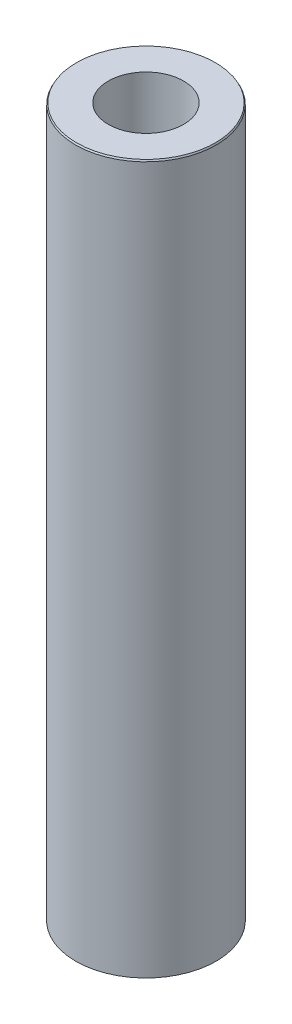
ISO-10303-21;
HEADER;
FILE_DESCRIPTION(('STEP AP214'),'2;1');
FILE_NAME('part.step','',(''),(''),'','','');
FILE_SCHEMA(('AUTOMOTIVE_DESIGN { 1 0 10303 214 1 1 1 1 }'));
ENDSEC;
DATA;
#1=APPLICATION_CONTEXT('core data for automotive mechanical design processes');
#2=APPLICATION_PROTOCOL_DEFINITION('international standard','automotive_design',2000,#1);
#3=PRODUCT_CONTEXT('',#1,'mechanical');
#4=PRODUCT('Part','Part','',(#3));
#5=PRODUCT_RELATED_PRODUCT_CATEGORY('part','',(#4));
#6=PRODUCT_DEFINITION_FORMATION('','',#4);
#7=PRODUCT_DEFINITION_CONTEXT('part definition',#1,'design');
#8=PRODUCT_DEFINITION('design','',#6,#7);
#9=PRODUCT_DEFINITION_SHAPE('','',#8);
#10=(LENGTH_UNIT() NAMED_UNIT(*) SI_UNIT(.MILLI.,.METRE.));
#11=(NAMED_UNIT(*) PLANE_ANGLE_UNIT() SI_UNIT($,.RADIAN.));
#12=(NAMED_UNIT(*) SI_UNIT($,.STERADIAN.) SOLID_ANGLE_UNIT());
#13=UNCERTAINTY_MEASURE_WITH_UNIT(LENGTH_MEASURE(1.E-05),#10,'distance_accuracy_value','');
#14=(GEOMETRIC_REPRESENTATION_CONTEXT(3) GLOBAL_UNCERTAINTY_ASSIGNED_CONTEXT((#13)) GLOBAL_UNIT_ASSIGNED_CONTEXT((#10,
#11,#12)) REPRESENTATION_CONTEXT('',''));
#15=CARTESIAN_POINT('',(0.,0.,0.));
#16=DIRECTION('',(0.,0.,1.));
#17=DIRECTION('',(1.,0.,0.));
#18=AXIS2_PLACEMENT_3D('',#15,#16,#17);
#19=CARTESIAN_POINT('',(0.,479.471370495916,0.));
#20=DIRECTION('',(0.,-1.,0.));
#21=DIRECTION('',(0.,0.,-1.));
#22=AXIS2_PLACEMENT_3D('',#19,#20,#21);
#23=CYLINDRICAL_SURFACE('',#22,47.5);
#24=CARTESIAN_POINT('',(0.,478.425476830958,0.));
#25=DIRECTION('',(0.,1.,0.));
#26=DIRECTION('',(0.,0.,1.));
#27=AXIS2_PLACEMENT_3D('',#24,#25,#26);
#28=CIRCLE('',#27,47.5);
#29=CARTESIAN_POINT('',(0.,478.425476830958,47.5));
#30=VERTEX_POINT('',#29);
#31=EDGE_CURVE('E50',#30,#30,#28,.F.);
#32=ORIENTED_EDGE('',*,*,#31,.T.);
#33=EDGE_LOOP('',(#32));
#34=FACE_BOUND('',#33,.T.);
#35=CARTESIAN_POINT('',(0.,0.543933611357739,0.));
#36=DIRECTION('',(0.,1.,0.));
#37=DIRECTION('',(0.,0.,1.));
#38=AXIS2_PLACEMENT_3D('',#35,#36,#37);
#39=CIRCLE('',#38,47.5);
#40=CARTESIAN_POINT('',(0.,0.543933611357739,47.5));
#41=VERTEX_POINT('',#40);
#42=EDGE_CURVE('E51',#41,#41,#39,.T.);
#43=ORIENTED_EDGE('',*,*,#42,.T.);
#44=EDGE_LOOP('',(#43));
#45=FACE_BOUND('',#44,.T.);
#46=ADVANCED_FACE('F39',(#34,#45),#23,.T.);
#47=CARTESIAN_POINT('',(0.,479.471370495916,0.));
#48=DIRECTION('',(0.,1.,0.));
#49=DIRECTION('',(0.,0.,1.));
#50=AXIS2_PLACEMENT_3D('',#47,#48,#49);
#51=PLANE('',#50);
#52=CARTESIAN_POINT('',(0.,479.471370495916,0.));
#53=DIRECTION('',(0.,1.,0.));
#54=DIRECTION('',(0.,0.,1.));
#55=AXIS2_PLACEMENT_3D('',#52,#53,#54);
#56=CIRCLE('',#55,46.9560663886422);
#57=CARTESIAN_POINT('',(0.,479.471370495916,46.9560663886422));
#58=VERTEX_POINT('',#57);
#59=EDGE_CURVE('E54',#58,#58,#56,.T.);
#60=ORIENTED_EDGE('',*,*,#59,.T.);
#61=EDGE_LOOP('',(#60));
#62=FACE_BOUND('',#61,.T.);
#63=CARTESIAN_POINT('',(0.,479.471370495916,0.));
#64=DIRECTION('',(0.,1.,0.));
#65=DIRECTION('',(0.,0.,1.));
#66=AXIS2_PLACEMENT_3D('',#63,#64,#65);
#67=CIRCLE('',#66,25.4495719222518);
#68=CARTESIAN_POINT('',(0.,479.471370495916,25.4495719222518));
#69=VERTEX_POINT('',#68);
#70=EDGE_CURVE('E58',#69,#69,#67,.T.);
#71=ORIENTED_EDGE('',*,*,#70,.F.);
#72=EDGE_LOOP('',(#71));
#73=FACE_BOUND('',#72,.T.);
#74=ADVANCED_FACE('F69',(#62,#73),#51,.T.);
#75=CARTESIAN_POINT('',(0.,0.,0.));
#76=DIRECTION('',(0.,1.,0.));
#77=DIRECTION('',(0.,0.,1.));
#78=AXIS2_PLACEMENT_3D('',#75,#76,#77);
#79=PLANE('',#78);
#80=CARTESIAN_POINT('',(0.,0.,0.));
#81=DIRECTION('',(0.,1.,0.));
#82=DIRECTION('',(0.,0.,1.));
#83=AXIS2_PLACEMENT_3D('',#80,#81,#82);
#84=CIRCLE('',#83,46.4541063350424);
#85=CARTESIAN_POINT('',(0.,0.,46.4541063350424));
#86=VERTEX_POINT('',#85);
#87=EDGE_CURVE('E10',#86,#86,#84,.F.);
#88=ORIENTED_EDGE('',*,*,#87,.T.);
#89=EDGE_LOOP('',(#88));
#90=FACE_BOUND('',#89,.T.);
#91=CARTESIAN_POINT('',(0.,0.,0.));
#92=DIRECTION('',(0.,1.,0.));
#93=DIRECTION('',(0.,0.,1.));
#94=AXIS2_PLACEMENT_3D('',#91,#92,#93);
#95=CIRCLE('',#94,25.4495719222518);
#96=CARTESIAN_POINT('',(0.,0.,25.4495719222518));
#97=VERTEX_POINT('',#96);
#98=EDGE_CURVE('E63',#97,#97,#95,.T.);
#99=ORIENTED_EDGE('',*,*,#98,.T.);
#100=EDGE_LOOP('',(#99));
#101=FACE_BOUND('',#100,.T.);
#102=ADVANCED_FACE('F75',(#90,#101),#79,.F.);
#103=CARTESIAN_POINT('',(0.,479.471370495916,0.));
#104=DIRECTION('',(0.,-1.,0.));
#105=DIRECTION('',(0.,0.,-1.));
#106=AXIS2_PLACEMENT_3D('',#103,#104,#105);
#107=CYLINDRICAL_SURFACE('',#106,25.4495719222518);
#108=ORIENTED_EDGE('',*,*,#70,.T.);
#109=EDGE_LOOP('',(#108));
#110=FACE_BOUND('',#109,.T.);
#111=ORIENTED_EDGE('',*,*,#98,.F.);
#112=EDGE_LOOP('',(#111));
#113=FACE_BOUND('',#112,.T.);
#114=ADVANCED_FACE('F70',(#110,#113),#107,.F.);
#115=CARTESIAN_POINT('',(0.,479.471370495916,0.));
#116=DIRECTION('',(0.,-1.,0.));
#117=DIRECTION('',(0.,0.,-1.));
#118=AXIS2_PLACEMENT_3D('',#115,#116,#117);
#119=CONICAL_SURFACE('',#118,46.9560663886422,0.479571149861031);
#120=ORIENTED_EDGE('',*,*,#31,.F.);
#121=EDGE_LOOP('',(#120));
#122=FACE_BOUND('',#121,.T.);
#123=ORIENTED_EDGE('',*,*,#59,.F.);
#124=EDGE_LOOP('',(#123));
#125=FACE_BOUND('',#124,.T.);
#126=ADVANCED_FACE('F81',(#122,#125),#119,.T.);
#127=CARTESIAN_POINT('',(0.,0.543933611357739,0.));
#128=DIRECTION('',(0.,1.,0.));
#129=DIRECTION('',(0.,0.,1.));
#130=AXIS2_PLACEMENT_3D('',#127,#128,#129);
#131=CONICAL_SURFACE('',#130,47.5,1.09122517693382);
#132=ORIENTED_EDGE('',*,*,#87,.F.);
#133=EDGE_LOOP('',(#132));
#134=FACE_BOUND('',#133,.T.);
#135=ORIENTED_EDGE('',*,*,#42,.F.);
#136=EDGE_LOOP('',(#135));
#137=FACE_BOUND('',#136,.T.);
#138=ADVANCED_FACE('F45',(#134,#137),#131,.T.);
#139=CLOSED_SHELL('',(#46,#74,#102,#114,#126,#138));
#140=MANIFOLD_SOLID_BREP('B2',#139);
#141=ADVANCED_BREP_SHAPE_REPRESENTATION('',(#18,#140),#14);
#142=SHAPE_DEFINITION_REPRESENTATION(#9,#141);
ENDSEC;
END-ISO-10303-21;
